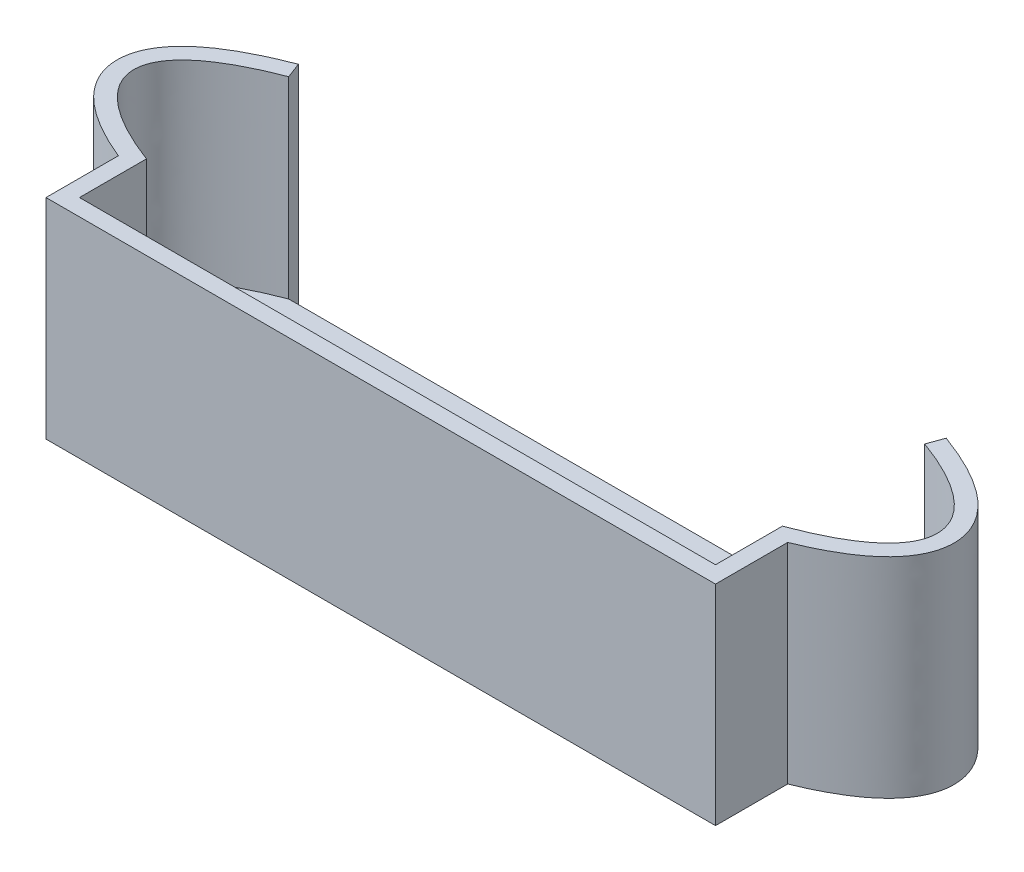
ISO-10303-21;
HEADER;
FILE_DESCRIPTION(('STEP AP214'),'2;1');
FILE_NAME('part.step','',(''),(''),'','','');
FILE_SCHEMA(('AUTOMOTIVE_DESIGN { 1 0 10303 214 1 1 1 1 }'));
ENDSEC;
DATA;
#1=APPLICATION_CONTEXT('core data for automotive mechanical design processes');
#2=APPLICATION_PROTOCOL_DEFINITION('international standard','automotive_design',2000,#1);
#3=PRODUCT_CONTEXT('',#1,'mechanical');
#4=PRODUCT('Part','Part','',(#3));
#5=PRODUCT_RELATED_PRODUCT_CATEGORY('part','',(#4));
#6=PRODUCT_DEFINITION_FORMATION('','',#4);
#7=PRODUCT_DEFINITION_CONTEXT('part definition',#1,'design');
#8=PRODUCT_DEFINITION('design','',#6,#7);
#9=PRODUCT_DEFINITION_SHAPE('','',#8);
#10=(LENGTH_UNIT() NAMED_UNIT(*) SI_UNIT(.MILLI.,.METRE.));
#11=(NAMED_UNIT(*) PLANE_ANGLE_UNIT() SI_UNIT($,.RADIAN.));
#12=(NAMED_UNIT(*) SI_UNIT($,.STERADIAN.) SOLID_ANGLE_UNIT());
#13=UNCERTAINTY_MEASURE_WITH_UNIT(LENGTH_MEASURE(1.E-05),#10,'distance_accuracy_value','');
#14=(GEOMETRIC_REPRESENTATION_CONTEXT(3) GLOBAL_UNCERTAINTY_ASSIGNED_CONTEXT((#13)) GLOBAL_UNIT_ASSIGNED_CONTEXT((#10,
#11,#12)) REPRESENTATION_CONTEXT('',''));
#15=CARTESIAN_POINT('',(0.,0.,0.));
#16=DIRECTION('',(0.,0.,1.));
#17=DIRECTION('',(1.,0.,0.));
#18=AXIS2_PLACEMENT_3D('',#15,#16,#17);
#19=CARTESIAN_POINT('',(-38.,25.,8.5));
#20=CARTESIAN_POINT('',(-44.0971734421418,25.,6.19197573313431));
#21=CARTESIAN_POINT('',(-51.2491163501438,25.,0.338068019417331));
#22=CARTESIAN_POINT('',(-45.4045938575706,25.,-5.68080966554712));
#23=CARTESIAN_POINT('',(-38.,25.,-8.5));
#24=B_SPLINE_CURVE_WITH_KNOTS('',3,(#19,#20,#21,#22,#23),.UNSPECIFIED.,.F.,.F.,(4,1,4),(0.,0.45,
1.),.UNSPECIFIED.);
#25=DIRECTION('',(0.,-1.,0.));
#26=VECTOR('',#25,1.);
#27=SURFACE_OF_LINEAR_EXTRUSION('',#24,#26);
#28=DIRECTION('',(0.,-1.,0.));
#29=VECTOR('',#28,1.);
#30=CARTESIAN_POINT('',(-38.,25.,8.5));
#31=LINE('',#30,#29);
#32=CARTESIAN_POINT('',(-38.,25.,8.5));
#33=VERTEX_POINT('',#32);
#34=CARTESIAN_POINT('',(-38.,2.,8.5));
#35=VERTEX_POINT('',#34);
#36=EDGE_CURVE('E224',#33,#35,#31,.T.);
#37=ORIENTED_EDGE('',*,*,#36,.T.);
#38=CARTESIAN_POINT('',(-38.,2.,-8.5));
#39=CARTESIAN_POINT('',(-45.4045938575706,2.,-5.68080966554712));
#40=CARTESIAN_POINT('',(-51.2491163501438,2.,0.338068019417331));
#41=CARTESIAN_POINT('',(-44.0971734421418,2.,6.19197573313431));
#42=CARTESIAN_POINT('',(-38.,2.,8.5));
#43=B_SPLINE_CURVE_WITH_KNOTS('',3,(#38,#39,#40,#41,#42),.UNSPECIFIED.,.F.,.F.,(4,1,4),(0.,0.55,
1.),.UNSPECIFIED.);
#44=CARTESIAN_POINT('',(-38.,2.,-8.5));
#45=VERTEX_POINT('',#44);
#46=EDGE_CURVE('E54',#45,#35,#43,.T.);
#47=ORIENTED_EDGE('',*,*,#46,.F.);
#48=DIRECTION('',(0.,-1.,0.));
#49=VECTOR('',#48,1.);
#50=CARTESIAN_POINT('',(-38.,25.,-8.5));
#51=LINE('',#50,#49);
#52=CARTESIAN_POINT('',(-38.,25.,-8.5));
#53=VERTEX_POINT('',#52);
#54=EDGE_CURVE('E11',#53,#45,#51,.T.);
#55=ORIENTED_EDGE('',*,*,#54,.F.);
#56=EDGE_CURVE('E255',#33,#53,#24,.T.);
#57=ORIENTED_EDGE('',*,*,#56,.F.);
#58=EDGE_LOOP('',(#37,#47,#55,#57));
#59=FACE_BOUND('',#58,.T.);
#60=ADVANCED_FACE('F37',(#59),#27,.F.);
#61=CARTESIAN_POINT('',(-38.7116363312719,25.,-10.3691104119377));
#62=DIRECTION('',(0.934555205968845,0.,-0.355818165635947));
#63=DIRECTION('',(-0.355818165635947,0.,-0.934555205968845));
#64=AXIS2_PLACEMENT_3D('',#61,#62,#63);
#65=PLANE('',#64);
#66=DIRECTION('',(0.355818165635947,0.,0.934555205968845));
#67=VECTOR('',#66,1.);
#68=CARTESIAN_POINT('',(-38.7116363312719,0.,-10.3691104119377));
#69=LINE('',#68,#67);
#70=CARTESIAN_POINT('',(-38.7116363312719,0.,-10.3691104119377));
#71=VERTEX_POINT('',#70);
#72=CARTESIAN_POINT('',(-38.,0.,-8.5));
#73=VERTEX_POINT('',#72);
#74=EDGE_CURVE('E196',#71,#73,#69,.T.);
#75=ORIENTED_EDGE('',*,*,#74,.F.);
#76=DIRECTION('',(0.,-1.,0.));
#77=VECTOR('',#76,1.);
#78=CARTESIAN_POINT('',(-38.7116363312719,25.,-10.3691104119377));
#79=LINE('',#78,#77);
#80=CARTESIAN_POINT('',(-38.7116363312719,25.,-10.3691104119377));
#81=VERTEX_POINT('',#80);
#82=EDGE_CURVE('E46',#81,#71,#79,.T.);
#83=ORIENTED_EDGE('',*,*,#82,.F.);
#84=DIRECTION('',(0.355818165635947,0.,0.934555205968845));
#85=VECTOR('',#84,1.);
#86=CARTESIAN_POINT('',(-38.7116363312719,25.,-10.3691104119377));
#87=LINE('',#86,#85);
#88=EDGE_CURVE('E337',#81,#53,#87,.T.);
#89=ORIENTED_EDGE('',*,*,#88,.T.);
#90=ORIENTED_EDGE('',*,*,#54,.T.);
#91=DIRECTION('',(0.,-1.,0.));
#92=VECTOR('',#91,1.);
#93=CARTESIAN_POINT('',(-38.,2.,-8.5));
#94=LINE('',#93,#92);
#95=EDGE_CURVE('E186',#45,#73,#94,.T.);
#96=ORIENTED_EDGE('',*,*,#95,.T.);
#97=EDGE_LOOP('',(#75,#83,#89,#90,#96));
#98=FACE_BOUND('',#97,.T.);
#99=ADVANCED_FACE('F346',(#98),#65,.T.);
#100=CARTESIAN_POINT('',(-40.,25.,9.85984179415552));
#101=CARTESIAN_POINT('',(-41.6063864526084,25.,9.19645826470229));
#102=CARTESIAN_POINT('',(-43.0174720162732,25.,8.50172508440663));
#103=CARTESIAN_POINT('',(-45.4697074365186,25.,7.03560230560447));
#104=CARTESIAN_POINT('',(-46.512220325183,25.,6.26485211397862));
#105=CARTESIAN_POINT('',(-47.8043142172775,25.,5.0167260805631));
#106=CARTESIAN_POINT('',(-48.1895286265625,25.,4.58490406327742));
#107=CARTESIAN_POINT('',(-48.8618289618267,25.,3.68164653878876));
#108=CARTESIAN_POINT('',(-49.1489459076632,25.,3.2098255576471));
#109=CARTESIAN_POINT('',(-49.6082667576355,25.,2.22445232530367));
#110=CARTESIAN_POINT('',(-49.7799238053162,25.,1.71080543782136));
#111=CARTESIAN_POINT('',(-49.9874166012136,25.,0.657795934772312));
#112=CARTESIAN_POINT('',(-50.0226849981645,25.,0.117692843150088));
#113=CARTESIAN_POINT('',(-49.9483087771157,25.,-0.954692848389449));
#114=CARTESIAN_POINT('',(-49.8389483432311,25.,-1.48594996611095));
#115=CARTESIAN_POINT('',(-49.4922541980677,25.,-2.51017001330792));
#116=CARTESIAN_POINT('',(-49.2556986890337,25.,-3.0031574293736));
#117=CARTESIAN_POINT('',(-48.6775995026154,25.,-3.94518996668276));
#118=CARTESIAN_POINT('',(-48.336215050652,25.,-4.3947265966794));
#119=CARTESIAN_POINT('',(-47.560818188255,25.,-5.25781189388135));
#120=CARTESIAN_POINT('',(-47.1266551704178,25.,-5.67159902471638));
#121=CARTESIAN_POINT('',(-45.6900809905153,25.,-6.87217662394887));
#122=CARTESIAN_POINT('',(-44.5538203088429,25.,-7.61960790130113));
#123=CARTESIAN_POINT('',(-41.9137015732495,25.,-9.04531685131512));
#124=CARTESIAN_POINT('',(-40.4090635509128,25.,-9.72283993402941));
#125=CARTESIAN_POINT('',(-38.7116363312719,25.,-10.3691104119377));
#126=B_SPLINE_CURVE_WITH_KNOTS('',3,(#100,#101,#102,#103,#104,#105,#106,#107,#108,#109,#110,
#111,#112,#113,#114,#115,#116,#117,#118,#119,#120,#121,#122,#123,#124,#125),.UNSPECIFIED.,.F.,
.F.,(4,2,2,2,2,2,2,2,2,2,2,2,4),(0.,0.125000000000001,0.250000000000001,0.312500000000001,
0.375000000000001,0.437500000000001,0.500000000000001,0.562500000000001,0.625000000000001,
0.687500000000001,0.750000000000001,0.875000000000001,1.),.UNSPECIFIED.);
#127=DIRECTION('',(0.,-1.,0.));
#128=VECTOR('',#127,1.);
#129=SURFACE_OF_LINEAR_EXTRUSION('',#126,#128);
#130=CARTESIAN_POINT('',(-40.,0.,9.85984179415552));
#131=CARTESIAN_POINT('',(-41.6063864526084,0.,9.19645826470229));
#132=CARTESIAN_POINT('',(-43.0174720162732,0.,8.50172508440663));
#133=CARTESIAN_POINT('',(-45.4697074365186,0.,7.03560230560447));
#134=CARTESIAN_POINT('',(-46.512220325183,0.,6.26485211397862));
#135=CARTESIAN_POINT('',(-47.8043142172775,0.,5.0167260805631));
#136=CARTESIAN_POINT('',(-48.1895286265625,0.,4.58490406327742));
#137=CARTESIAN_POINT('',(-48.8618289618267,0.,3.68164653878876));
#138=CARTESIAN_POINT('',(-49.1489459076632,0.,3.2098255576471));
#139=CARTESIAN_POINT('',(-49.6082667576355,0.,2.22445232530367));
#140=CARTESIAN_POINT('',(-49.7799238053162,0.,1.71080543782136));
#141=CARTESIAN_POINT('',(-49.9874166012136,0.,0.657795934772312));
#142=CARTESIAN_POINT('',(-50.0226849981645,0.,0.117692843150088));
#143=CARTESIAN_POINT('',(-49.9483087771157,0.,-0.954692848389449));
#144=CARTESIAN_POINT('',(-49.8389483432311,0.,-1.48594996611095));
#145=CARTESIAN_POINT('',(-49.4922541980677,0.,-2.51017001330792));
#146=CARTESIAN_POINT('',(-49.2556986890337,0.,-3.0031574293736));
#147=CARTESIAN_POINT('',(-48.6775995026154,0.,-3.94518996668276));
#148=CARTESIAN_POINT('',(-48.336215050652,0.,-4.3947265966794));
#149=CARTESIAN_POINT('',(-47.560818188255,0.,-5.25781189388135));
#150=CARTESIAN_POINT('',(-47.1266551704178,0.,-5.67159902471638));
#151=CARTESIAN_POINT('',(-45.6900809905153,0.,-6.87217662394887));
#152=CARTESIAN_POINT('',(-44.5538203088429,0.,-7.61960790130113));
#153=CARTESIAN_POINT('',(-41.9137015732495,0.,-9.04531685131512));
#154=CARTESIAN_POINT('',(-40.4090635509128,0.,-9.72283993402941));
#155=CARTESIAN_POINT('',(-38.7116363312719,0.,-10.3691104119377));
#156=B_SPLINE_CURVE_WITH_KNOTS('',3,(#130,#131,#132,#133,#134,#135,#136,#137,#138,#139,#140,
#141,#142,#143,#144,#145,#146,#147,#148,#149,#150,#151,#152,#153,#154,#155),.UNSPECIFIED.,.F.,
.F.,(4,2,2,2,2,2,2,2,2,2,2,2,4),(0.,0.125000000000001,0.250000000000001,0.312500000000001,
0.375000000000001,0.437500000000001,0.500000000000001,0.562500000000001,0.625000000000001,
0.687500000000001,0.750000000000001,0.875000000000001,1.),.UNSPECIFIED.);
#157=CARTESIAN_POINT('',(-40.,0.,9.85984179415552));
#158=VERTEX_POINT('',#157);
#159=EDGE_CURVE('E276',#158,#71,#156,.T.);
#160=ORIENTED_EDGE('',*,*,#159,.F.);
#161=DIRECTION('',(0.,-1.,0.));
#162=VECTOR('',#161,1.);
#163=CARTESIAN_POINT('',(-40.,25.,9.85984179415552));
#164=LINE('',#163,#162);
#165=CARTESIAN_POINT('',(-40.,25.,9.85984179415552));
#166=VERTEX_POINT('',#165);
#167=EDGE_CURVE('E221',#166,#158,#164,.T.);
#168=ORIENTED_EDGE('',*,*,#167,.F.);
#169=EDGE_CURVE('E331',#166,#81,#126,.T.);
#170=ORIENTED_EDGE('',*,*,#169,.T.);
#171=ORIENTED_EDGE('',*,*,#82,.T.);
#172=EDGE_LOOP('',(#160,#168,#170,#171));
#173=FACE_BOUND('',#172,.T.);
#174=ADVANCED_FACE('F342',(#173),#129,.T.);
#175=CARTESIAN_POINT('',(-40.,25.,8.5));
#176=DIRECTION('',(-1.,0.,0.));
#177=DIRECTION('',(0.,0.,1.));
#178=AXIS2_PLACEMENT_3D('',#175,#176,#177);
#179=PLANE('',#178);
#180=DIRECTION('',(0.,0.,-1.));
#181=VECTOR('',#180,1.);
#182=CARTESIAN_POINT('',(-40.,0.,8.5));
#183=LINE('',#182,#181);
#184=CARTESIAN_POINT('',(-40.,0.,18.5));
#185=VERTEX_POINT('',#184);
#186=EDGE_CURVE('E273',#185,#158,#183,.T.);
#187=ORIENTED_EDGE('',*,*,#186,.F.);
#188=DIRECTION('',(0.,-1.,0.));
#189=VECTOR('',#188,1.);
#190=CARTESIAN_POINT('',(-40.,25.,18.5));
#191=LINE('',#190,#189);
#192=CARTESIAN_POINT('',(-40.,25.,18.5));
#193=VERTEX_POINT('',#192);
#194=EDGE_CURVE('E219',#193,#185,#191,.T.);
#195=ORIENTED_EDGE('',*,*,#194,.F.);
#196=DIRECTION('',(0.,0.,-1.));
#197=VECTOR('',#196,1.);
#198=CARTESIAN_POINT('',(-40.,25.,8.5));
#199=LINE('',#198,#197);
#200=EDGE_CURVE('E328',#193,#166,#199,.T.);
#201=ORIENTED_EDGE('',*,*,#200,.T.);
#202=ORIENTED_EDGE('',*,*,#167,.T.);
#203=EDGE_LOOP('',(#187,#195,#201,#202));
#204=FACE_BOUND('',#203,.T.);
#205=ADVANCED_FACE('F345',(#204),#179,.T.);
#206=CARTESIAN_POINT('',(38.,25.,18.5));
#207=DIRECTION('',(0.,0.,1.));
#208=DIRECTION('',(1.,0.,0.));
#209=AXIS2_PLACEMENT_3D('',#206,#207,#208);
#210=PLANE('',#209);
#211=DIRECTION('',(-1.,0.,0.));
#212=VECTOR('',#211,1.);
#213=CARTESIAN_POINT('',(38.,0.,18.5));
#214=LINE('',#213,#212);
#215=CARTESIAN_POINT('',(40.,0.,18.5));
#216=VERTEX_POINT('',#215);
#217=EDGE_CURVE('E270',#216,#185,#214,.T.);
#218=ORIENTED_EDGE('',*,*,#217,.F.);
#219=DIRECTION('',(0.,-1.,0.));
#220=VECTOR('',#219,1.);
#221=CARTESIAN_POINT('',(40.,25.,18.5));
#222=LINE('',#221,#220);
#223=CARTESIAN_POINT('',(40.,25.,18.5));
#224=VERTEX_POINT('',#223);
#225=EDGE_CURVE('E217',#224,#216,#222,.T.);
#226=ORIENTED_EDGE('',*,*,#225,.F.);
#227=DIRECTION('',(-1.,0.,0.));
#228=VECTOR('',#227,1.);
#229=CARTESIAN_POINT('',(38.,25.,18.5));
#230=LINE('',#229,#228);
#231=EDGE_CURVE('E325',#224,#193,#230,.T.);
#232=ORIENTED_EDGE('',*,*,#231,.T.);
#233=ORIENTED_EDGE('',*,*,#194,.T.);
#234=EDGE_LOOP('',(#218,#226,#232,#233));
#235=FACE_BOUND('',#234,.T.);
#236=ADVANCED_FACE('F367',(#235),#210,.T.);
#237=CARTESIAN_POINT('',(40.,25.,16.5));
#238=DIRECTION('',(1.,0.,0.));
#239=DIRECTION('',(0.,0.,-1.));
#240=AXIS2_PLACEMENT_3D('',#237,#238,#239);
#241=PLANE('',#240);
#242=DIRECTION('',(0.,0.,-1.));
#243=VECTOR('',#242,1.);
#244=CARTESIAN_POINT('',(40.,0.,16.5));
#245=LINE('',#244,#243);
#246=CARTESIAN_POINT('',(40.,0.,9.87368656754377));
#247=VERTEX_POINT('',#246);
#248=EDGE_CURVE('E264',#247,#216,#245,.F.);
#249=ORIENTED_EDGE('',*,*,#248,.F.);
#250=DIRECTION('',(0.,-1.,0.));
#251=VECTOR('',#250,1.);
#252=CARTESIAN_POINT('',(40.,25.,9.87368656754377));
#253=LINE('',#252,#251);
#254=CARTESIAN_POINT('',(40.,25.,9.87368656754377));
#255=VERTEX_POINT('',#254);
#256=EDGE_CURVE('E203',#255,#247,#253,.T.);
#257=ORIENTED_EDGE('',*,*,#256,.F.);
#258=DIRECTION('',(0.,0.,-1.));
#259=VECTOR('',#258,1.);
#260=CARTESIAN_POINT('',(40.,25.,16.5));
#261=LINE('',#260,#259);
#262=EDGE_CURVE('E319',#255,#224,#261,.F.);
#263=ORIENTED_EDGE('',*,*,#262,.T.);
#264=ORIENTED_EDGE('',*,*,#225,.T.);
#265=EDGE_LOOP('',(#249,#257,#263,#264));
#266=FACE_BOUND('',#265,.T.);
#267=ADVANCED_FACE('F310',(#266),#241,.T.);
#268=CARTESIAN_POINT('',(38.6840402866513,25.,-10.3793852415718));
#269=CARTESIAN_POINT('',(40.4041465230962,25.,-9.75331777173025));
#270=CARTESIAN_POINT('',(41.9229970966462,25.,-9.08800470112597));
#271=CARTESIAN_POINT('',(44.5807786086229,25.,-7.67329587995447));
#272=CARTESIAN_POINT('',(45.7205980606713,25.,-6.92450869545767));
#273=CARTESIAN_POINT('',(47.1569084210353,25.,-5.7145854775236));
#274=CARTESIAN_POINT('',(47.5900013984811,25.,-5.29648160097566));
#275=CARTESIAN_POINT('',(48.3613112665575,25.,-4.42375033228293));
#276=CARTESIAN_POINT('',(48.6996296746018,25.,-3.96888379386021));
#277=CARTESIAN_POINT('',(49.2702102761331,25.,-3.01773228404028));
#278=CARTESIAN_POINT('',(49.5022653836234,25.,-2.52105780820636));
#279=CARTESIAN_POINT('',(49.8414781111882,25.,-1.49356308768047));
#280=CARTESIAN_POINT('',(49.9483170520087,25.,-0.963257165414898));
#281=CARTESIAN_POINT('',(50.022307254117,25.,0.110491836494699));
#282=CARTESIAN_POINT('',(49.988715689813,25.,0.65260655556458));
#283=CARTESIAN_POINT('',(49.7839180039266,25.,1.71370272063874));
#284=CARTESIAN_POINT('',(49.6133325526311,25.,2.23212300577642));
#285=CARTESIAN_POINT('',(49.1553780326123,25.,3.22679565727581));
#286=CARTESIAN_POINT('',(48.8684940733341,25.,3.70336233424624));
#287=CARTESIAN_POINT('',(48.1957238702478,25.,4.61535639178563));
#288=CARTESIAN_POINT('',(47.809819506945,25.,5.05115075983745));
#289=CARTESIAN_POINT('',(46.5149676868667,25.,6.30860523877756));
#290=CARTESIAN_POINT('',(45.4697633562874,25.,7.08204391798738));
#291=CARTESIAN_POINT('',(43.0147461426226,25.,8.54162187618837));
#292=CARTESIAN_POINT('',(41.6035652881565,25.,9.22719501734774));
#293=CARTESIAN_POINT('',(40.,25.,9.87368656754377));
#294=B_SPLINE_CURVE_WITH_KNOTS('',3,(#268,#269,#270,#271,#272,#273,#274,#275,#276,#277,#278,
#279,#280,#281,#282,#283,#284,#285,#286,#287,#288,#289,#290,#291,#292,#293),.UNSPECIFIED.,.F.,
.F.,(4,2,2,2,2,2,2,2,2,2,2,2,4),(0.,0.125,0.25,0.3125,0.375,0.4375,0.5,0.5625,0.625000000000001,
0.687500000000001,0.750000000000001,0.875,1.),.UNSPECIFIED.);
#295=DIRECTION('',(0.,-1.,0.));
#296=VECTOR('',#295,1.);
#297=SURFACE_OF_LINEAR_EXTRUSION('',#294,#296);
#298=CARTESIAN_POINT('',(38.6840402866513,0.,-10.3793852415718));
#299=CARTESIAN_POINT('',(40.4041465230962,0.,-9.75331777173025));
#300=CARTESIAN_POINT('',(41.9229970966462,0.,-9.08800470112597));
#301=CARTESIAN_POINT('',(44.5807786086229,0.,-7.67329587995447));
#302=CARTESIAN_POINT('',(45.7205980606713,0.,-6.92450869545767));
#303=CARTESIAN_POINT('',(47.1569084210353,0.,-5.7145854775236));
#304=CARTESIAN_POINT('',(47.5900013984811,0.,-5.29648160097566));
#305=CARTESIAN_POINT('',(48.3613112665575,0.,-4.42375033228293));
#306=CARTESIAN_POINT('',(48.6996296746018,0.,-3.96888379386021));
#307=CARTESIAN_POINT('',(49.2702102761331,0.,-3.01773228404028));
#308=CARTESIAN_POINT('',(49.5022653836234,0.,-2.52105780820636));
#309=CARTESIAN_POINT('',(49.8414781111882,0.,-1.49356308768047));
#310=CARTESIAN_POINT('',(49.9483170520087,0.,-0.963257165414898));
#311=CARTESIAN_POINT('',(50.022307254117,0.,0.110491836494699));
#312=CARTESIAN_POINT('',(49.988715689813,0.,0.65260655556458));
#313=CARTESIAN_POINT('',(49.7839180039266,0.,1.71370272063874));
#314=CARTESIAN_POINT('',(49.6133325526311,0.,2.23212300577642));
#315=CARTESIAN_POINT('',(49.1553780326123,0.,3.22679565727581));
#316=CARTESIAN_POINT('',(48.8684940733341,0.,3.70336233424624));
#317=CARTESIAN_POINT('',(48.1957238702478,0.,4.61535639178563));
#318=CARTESIAN_POINT('',(47.809819506945,0.,5.05115075983745));
#319=CARTESIAN_POINT('',(46.5149676868667,0.,6.30860523877756));
#320=CARTESIAN_POINT('',(45.4697633562874,0.,7.08204391798738));
#321=CARTESIAN_POINT('',(43.0147461426226,0.,8.54162187618837));
#322=CARTESIAN_POINT('',(41.6035652881565,0.,9.22719501734774));
#323=CARTESIAN_POINT('',(40.,0.,9.87368656754377));
#324=B_SPLINE_CURVE_WITH_KNOTS('',3,(#298,#299,#300,#301,#302,#303,#304,#305,#306,#307,#308,
#309,#310,#311,#312,#313,#314,#315,#316,#317,#318,#319,#320,#321,#322,#323),.UNSPECIFIED.,.F.,
.F.,(4,2,2,2,2,2,2,2,2,2,2,2,4),(0.,0.125,0.25,0.3125,0.375,0.4375,0.5,0.5625,0.625000000000001,
0.687500000000001,0.750000000000001,0.875,1.),.UNSPECIFIED.);
#325=CARTESIAN_POINT('',(38.6840402866513,0.,-10.3793852415718));
#326=VERTEX_POINT('',#325);
#327=EDGE_CURVE('E259',#326,#247,#324,.T.);
#328=ORIENTED_EDGE('',*,*,#327,.F.);
#329=DIRECTION('',(0.,-1.,0.));
#330=VECTOR('',#329,1.);
#331=CARTESIAN_POINT('',(38.6840402866513,25.,-10.3793852415718));
#332=LINE('',#331,#330);
#333=CARTESIAN_POINT('',(38.6840402866513,25.,-10.3793852415718));
#334=VERTEX_POINT('',#333);
#335=EDGE_CURVE('E200',#334,#326,#332,.T.);
#336=ORIENTED_EDGE('',*,*,#335,.F.);
#337=EDGE_CURVE('E313',#334,#255,#294,.T.);
#338=ORIENTED_EDGE('',*,*,#337,.T.);
#339=ORIENTED_EDGE('',*,*,#256,.T.);
#340=EDGE_LOOP('',(#328,#336,#338,#339));
#341=FACE_BOUND('',#340,.T.);
#342=ADVANCED_FACE('F307',(#341),#297,.T.);
#343=CARTESIAN_POINT('',(38.,25.,-8.50000000000001));
#344=DIRECTION('',(-0.939692620785908,0.,-0.342020143325669));
#345=DIRECTION('',(-0.342020143325669,0.,0.939692620785908));
#346=AXIS2_PLACEMENT_3D('',#343,#344,#345);
#347=PLANE('',#346);
#348=DIRECTION('',(0.342020143325669,0.,-0.939692620785908));
#349=VECTOR('',#348,1.);
#350=CARTESIAN_POINT('',(38.,0.,-8.50000000000001));
#351=LINE('',#350,#349);
#352=CARTESIAN_POINT('',(38.,0.,-8.5));
#353=VERTEX_POINT('',#352);
#354=EDGE_CURVE('E195',#353,#326,#351,.T.);
#355=ORIENTED_EDGE('',*,*,#354,.F.);
#356=DIRECTION('',(0.,-1.,0.));
#357=VECTOR('',#356,1.);
#358=CARTESIAN_POINT('',(38.,2.,-8.5));
#359=LINE('',#358,#357);
#360=CARTESIAN_POINT('',(38.,2.,-8.5));
#361=VERTEX_POINT('',#360);
#362=EDGE_CURVE('E184',#361,#353,#359,.T.);
#363=ORIENTED_EDGE('',*,*,#362,.F.);
#364=DIRECTION('',(0.,-1.,0.));
#365=VECTOR('',#364,1.);
#366=CARTESIAN_POINT('',(38.,25.,-8.50000000000001));
#367=LINE('',#366,#365);
#368=CARTESIAN_POINT('',(38.,25.,-8.50000000000001));
#369=VERTEX_POINT('',#368);
#370=EDGE_CURVE('E192',#369,#361,#367,.T.);
#371=ORIENTED_EDGE('',*,*,#370,.F.);
#372=DIRECTION('',(0.342020143325669,0.,-0.939692620785908));
#373=VECTOR('',#372,1.);
#374=CARTESIAN_POINT('',(38.,25.,-8.50000000000001));
#375=LINE('',#374,#373);
#376=EDGE_CURVE('E294',#369,#334,#375,.T.);
#377=ORIENTED_EDGE('',*,*,#376,.T.);
#378=ORIENTED_EDGE('',*,*,#335,.T.);
#379=EDGE_LOOP('',(#355,#363,#371,#377,#378));
#380=FACE_BOUND('',#379,.T.);
#381=ADVANCED_FACE('F190',(#380),#347,.T.);
#382=CARTESIAN_POINT('',(38.,25.,-8.50000000000001));
#383=CARTESIAN_POINT('',(44.1262265687642,25.,-6.27023588059907));
#384=CARTESIAN_POINT('',(51.2239369737377,25.,-0.356097076359375));
#385=CARTESIAN_POINT('',(45.4258994837604,25.,5.77760659667593));
#386=CARTESIAN_POINT('',(38.,25.,8.49999999999999));
#387=B_SPLINE_CURVE_WITH_KNOTS('',3,(#382,#383,#384,#385,#386),.UNSPECIFIED.,.F.,.F.,(4,1,4),
(0.,0.45,1.),.UNSPECIFIED.);
#388=DIRECTION('',(0.,-1.,0.));
#389=VECTOR('',#388,1.);
#390=SURFACE_OF_LINEAR_EXTRUSION('',#387,#389);
#391=ORIENTED_EDGE('',*,*,#370,.T.);
#392=CARTESIAN_POINT('',(38.,2.,-8.50000000000001));
#393=CARTESIAN_POINT('',(44.1262265687642,2.,-6.27023588059907));
#394=CARTESIAN_POINT('',(51.2239369737377,2.,-0.356097076359375));
#395=CARTESIAN_POINT('',(45.4258994837604,2.,5.77760659667593));
#396=CARTESIAN_POINT('',(38.,2.,8.49999999999999));
#397=B_SPLINE_CURVE_WITH_KNOTS('',3,(#392,#393,#394,#395,#396),.UNSPECIFIED.,.F.,.F.,(4,1,4),
(0.,0.45,1.),.UNSPECIFIED.);
#398=CARTESIAN_POINT('',(38.,2.,8.5));
#399=VERTEX_POINT('',#398);
#400=EDGE_CURVE('E167',#361,#399,#397,.T.);
#401=ORIENTED_EDGE('',*,*,#400,.T.);
#402=DIRECTION('',(0.,-1.,0.));
#403=VECTOR('',#402,1.);
#404=CARTESIAN_POINT('',(38.,25.,8.5));
#405=LINE('',#404,#403);
#406=CARTESIAN_POINT('',(38.,25.,8.5));
#407=VERTEX_POINT('',#406);
#408=EDGE_CURVE('E201',#407,#399,#405,.T.);
#409=ORIENTED_EDGE('',*,*,#408,.F.);
#410=EDGE_CURVE('E198',#369,#407,#387,.T.);
#411=ORIENTED_EDGE('',*,*,#410,.F.);
#412=EDGE_LOOP('',(#391,#401,#409,#411));
#413=FACE_BOUND('',#412,.T.);
#414=ADVANCED_FACE('F197',(#413),#390,.F.);
#415=CARTESIAN_POINT('',(38.,25.,16.5));
#416=DIRECTION('',(1.,0.,0.));
#417=DIRECTION('',(0.,0.,-1.));
#418=AXIS2_PLACEMENT_3D('',#415,#416,#417);
#419=PLANE('',#418);
#420=DIRECTION('',(0.,0.,1.));
#421=VECTOR('',#420,1.);
#422=CARTESIAN_POINT('',(38.,0.,16.5));
#423=LINE('',#422,#421);
#424=CARTESIAN_POINT('',(38.,0.,8.5));
#425=VERTEX_POINT('',#424);
#426=CARTESIAN_POINT('',(38.,0.,16.5));
#427=VERTEX_POINT('',#426);
#428=EDGE_CURVE('E251',#425,#427,#423,.T.);
#429=ORIENTED_EDGE('',*,*,#428,.T.);
#430=DIRECTION('',(0.,-1.,0.));
#431=VECTOR('',#430,1.);
#432=CARTESIAN_POINT('',(38.,25.,16.5));
#433=LINE('',#432,#431);
#434=CARTESIAN_POINT('',(38.,25.,16.5));
#435=VERTEX_POINT('',#434);
#436=EDGE_CURVE('E205',#435,#427,#433,.T.);
#437=ORIENTED_EDGE('',*,*,#436,.F.);
#438=DIRECTION('',(0.,0.,1.));
#439=VECTOR('',#438,1.);
#440=CARTESIAN_POINT('',(38.,25.,16.5));
#441=LINE('',#440,#439);
#442=EDGE_CURVE('E288',#407,#435,#441,.T.);
#443=ORIENTED_EDGE('',*,*,#442,.F.);
#444=ORIENTED_EDGE('',*,*,#408,.T.);
#445=DIRECTION('',(0.,-1.,0.));
#446=VECTOR('',#445,1.);
#447=CARTESIAN_POINT('',(38.,2.,8.5));
#448=LINE('',#447,#446);
#449=EDGE_CURVE('E560',#399,#425,#448,.T.);
#450=ORIENTED_EDGE('',*,*,#449,.T.);
#451=EDGE_LOOP('',(#429,#437,#443,#444,#450));
#452=FACE_BOUND('',#451,.T.);
#453=ADVANCED_FACE('F303',(#452),#419,.F.);
#454=CARTESIAN_POINT('',(38.,25.,16.5));
#455=DIRECTION('',(0.,0.,1.));
#456=DIRECTION('',(1.,0.,0.));
#457=AXIS2_PLACEMENT_3D('',#454,#455,#456);
#458=PLANE('',#457);
#459=DIRECTION('',(-1.,0.,0.));
#460=VECTOR('',#459,1.);
#461=CARTESIAN_POINT('',(0.,2.,16.5));
#462=LINE('',#461,#460);
#463=CARTESIAN_POINT('',(2.4423397518385,2.,16.5));
#464=VERTEX_POINT('',#463);
#465=CARTESIAN_POINT('',(-2.5576602481615,2.,16.5));
#466=VERTEX_POINT('',#465);
#467=EDGE_CURVE('E61',#464,#466,#462,.T.);
#468=ORIENTED_EDGE('',*,*,#467,.T.);
#469=DIRECTION('',(0.,-1.,0.));
#470=VECTOR('',#469,1.);
#471=CARTESIAN_POINT('',(-2.5576602481615,2.,16.5));
#472=LINE('',#471,#470);
#473=CARTESIAN_POINT('',(-2.5576602481615,0.,16.5));
#474=VERTEX_POINT('',#473);
#475=EDGE_CURVE('E562',#466,#474,#472,.T.);
#476=ORIENTED_EDGE('',*,*,#475,.T.);
#477=DIRECTION('',(-1.,0.,0.));
#478=VECTOR('',#477,1.);
#479=CARTESIAN_POINT('',(38.,0.,16.5));
#480=LINE('',#479,#478);
#481=CARTESIAN_POINT('',(-38.,0.,16.5));
#482=VERTEX_POINT('',#481);
#483=EDGE_CURVE('E254',#474,#482,#480,.T.);
#484=ORIENTED_EDGE('',*,*,#483,.T.);
#485=DIRECTION('',(0.,-1.,0.));
#486=VECTOR('',#485,1.);
#487=CARTESIAN_POINT('',(-38.,25.,16.5));
#488=LINE('',#487,#486);
#489=CARTESIAN_POINT('',(-38.,25.,16.5));
#490=VERTEX_POINT('',#489);
#491=EDGE_CURVE('E226',#490,#482,#488,.T.);
#492=ORIENTED_EDGE('',*,*,#491,.F.);
#493=DIRECTION('',(-1.,0.,0.));
#494=VECTOR('',#493,1.);
#495=CARTESIAN_POINT('',(38.,25.,16.5));
#496=LINE('',#495,#494);
#497=EDGE_CURVE('E242',#435,#490,#496,.T.);
#498=ORIENTED_EDGE('',*,*,#497,.F.);
#499=ORIENTED_EDGE('',*,*,#436,.T.);
#500=CARTESIAN_POINT('',(2.4423397518385,0.,16.5));
#501=VERTEX_POINT('',#500);
#502=EDGE_CURVE('E239',#427,#501,#480,.T.);
#503=ORIENTED_EDGE('',*,*,#502,.T.);
#504=DIRECTION('',(0.,-1.,0.));
#505=VECTOR('',#504,1.);
#506=CARTESIAN_POINT('',(2.4423397518385,2.,16.5));
#507=LINE('',#506,#505);
#508=EDGE_CURVE('E559',#464,#501,#507,.T.);
#509=ORIENTED_EDGE('',*,*,#508,.F.);
#510=EDGE_LOOP('',(#468,#476,#484,#492,#498,#499,#503,#509));
#511=FACE_BOUND('',#510,.T.);
#512=ADVANCED_FACE('F238',(#511),#458,.F.);
#513=CARTESIAN_POINT('',(-38.,25.,8.5));
#514=DIRECTION('',(-1.,0.,0.));
#515=DIRECTION('',(0.,0.,1.));
#516=AXIS2_PLACEMENT_3D('',#513,#514,#515);
#517=PLANE('',#516);
#518=DIRECTION('',(0.,0.,-1.));
#519=VECTOR('',#518,1.);
#520=CARTESIAN_POINT('',(-38.,0.,8.5));
#521=LINE('',#520,#519);
#522=CARTESIAN_POINT('',(-38.,0.,8.5));
#523=VERTEX_POINT('',#522);
#524=EDGE_CURVE('E231',#482,#523,#521,.T.);
#525=ORIENTED_EDGE('',*,*,#524,.T.);
#526=DIRECTION('',(0.,-1.,0.));
#527=VECTOR('',#526,1.);
#528=CARTESIAN_POINT('',(-38.,2.,8.5));
#529=LINE('',#528,#527);
#530=EDGE_CURVE('E547',#35,#523,#529,.T.);
#531=ORIENTED_EDGE('',*,*,#530,.F.);
#532=ORIENTED_EDGE('',*,*,#36,.F.);
#533=DIRECTION('',(0.,0.,-1.));
#534=VECTOR('',#533,1.);
#535=CARTESIAN_POINT('',(-38.,25.,8.5));
#536=LINE('',#535,#534);
#537=EDGE_CURVE('E227',#490,#33,#536,.T.);
#538=ORIENTED_EDGE('',*,*,#537,.F.);
#539=ORIENTED_EDGE('',*,*,#491,.T.);
#540=EDGE_LOOP('',(#525,#531,#532,#538,#539));
#541=FACE_BOUND('',#540,.T.);
#542=ADVANCED_FACE('F378',(#541),#517,.F.);
#543=CARTESIAN_POINT('',(-48.,25.,0.));
#544=DIRECTION('',(0.,1.,0.));
#545=DIRECTION('',(1.,0.,0.));
#546=AXIS2_PLACEMENT_3D('',#543,#544,#545);
#547=PLANE('',#546);
#548=ORIENTED_EDGE('',*,*,#56,.T.);
#549=ORIENTED_EDGE('',*,*,#88,.F.);
#550=ORIENTED_EDGE('',*,*,#169,.F.);
#551=ORIENTED_EDGE('',*,*,#200,.F.);
#552=ORIENTED_EDGE('',*,*,#231,.F.);
#553=ORIENTED_EDGE('',*,*,#262,.F.);
#554=ORIENTED_EDGE('',*,*,#337,.F.);
#555=ORIENTED_EDGE('',*,*,#376,.F.);
#556=ORIENTED_EDGE('',*,*,#410,.T.);
#557=ORIENTED_EDGE('',*,*,#442,.T.);
#558=ORIENTED_EDGE('',*,*,#497,.T.);
#559=ORIENTED_EDGE('',*,*,#537,.T.);
#560=EDGE_LOOP('',(#548,#549,#550,#551,#552,#553,#554,#555,#556,#557,#558,#559));
#561=FACE_BOUND('',#560,.T.);
#562=ADVANCED_FACE('F362',(#561),#547,.T.);
#563=CARTESIAN_POINT('',(-48.,0.,0.));
#564=DIRECTION('',(0.,1.,0.));
#565=DIRECTION('',(1.,0.,0.));
#566=AXIS2_PLACEMENT_3D('',#563,#564,#565);
#567=PLANE('',#566);
#568=ORIENTED_EDGE('',*,*,#74,.T.);
#569=DIRECTION('',(1.,0.,0.));
#570=VECTOR('',#569,1.);
#571=CARTESIAN_POINT('',(0.,0.,-8.5));
#572=LINE('',#571,#570);
#573=EDGE_CURVE('E550',#73,#353,#572,.T.);
#574=ORIENTED_EDGE('',*,*,#573,.T.);
#575=ORIENTED_EDGE('',*,*,#354,.T.);
#576=ORIENTED_EDGE('',*,*,#327,.T.);
#577=ORIENTED_EDGE('',*,*,#248,.T.);
#578=ORIENTED_EDGE('',*,*,#217,.T.);
#579=ORIENTED_EDGE('',*,*,#186,.T.);
#580=ORIENTED_EDGE('',*,*,#159,.T.);
#581=EDGE_LOOP('',(#568,#574,#575,#576,#577,#578,#579,#580));
#582=FACE_BOUND('',#581,.T.);
#583=ORIENTED_EDGE('',*,*,#428,.F.);
#584=DIRECTION('',(-1.,0.,0.));
#585=VECTOR('',#584,1.);
#586=CARTESIAN_POINT('',(0.,0.,8.5));
#587=LINE('',#586,#585);
#588=CARTESIAN_POINT('',(2.4423397518385,0.,8.5));
#589=VERTEX_POINT('',#588);
#590=EDGE_CURVE('E177',#425,#589,#587,.T.);
#591=ORIENTED_EDGE('',*,*,#590,.T.);
#592=DIRECTION('',(0.,0.,-1.));
#593=VECTOR('',#592,1.);
#594=CARTESIAN_POINT('',(2.4423397518385,0.,0.));
#595=LINE('',#594,#593);
#596=EDGE_CURVE('E253',#501,#589,#595,.T.);
#597=ORIENTED_EDGE('',*,*,#596,.F.);
#598=ORIENTED_EDGE('',*,*,#502,.F.);
#599=EDGE_LOOP('',(#583,#591,#597,#598));
#600=FACE_BOUND('',#599,.T.);
#601=CARTESIAN_POINT('',(-2.5576602481615,0.,8.5));
#602=VERTEX_POINT('',#601);
#603=EDGE_CURVE('E542',#602,#523,#587,.T.);
#604=ORIENTED_EDGE('',*,*,#603,.T.);
#605=ORIENTED_EDGE('',*,*,#524,.F.);
#606=ORIENTED_EDGE('',*,*,#483,.F.);
#607=DIRECTION('',(0.,0.,-1.));
#608=VECTOR('',#607,1.);
#609=CARTESIAN_POINT('',(-2.5576602481615,0.,0.));
#610=LINE('',#609,#608);
#611=EDGE_CURVE('E549',#474,#602,#610,.T.);
#612=ORIENTED_EDGE('',*,*,#611,.T.);
#613=EDGE_LOOP('',(#604,#605,#606,#612));
#614=FACE_BOUND('',#613,.T.);
#615=ADVANCED_FACE('F248',(#582,#600,#614),#567,.F.);
#616=CARTESIAN_POINT('',(0.,2.,-8.5));
#617=DIRECTION('',(0.,0.,-1.));
#618=DIRECTION('',(-1.,0.,0.));
#619=AXIS2_PLACEMENT_3D('',#616,#617,#618);
#620=PLANE('',#619);
#621=ORIENTED_EDGE('',*,*,#573,.F.);
#622=ORIENTED_EDGE('',*,*,#95,.F.);
#623=DIRECTION('',(1.,0.,0.));
#624=VECTOR('',#623,1.);
#625=CARTESIAN_POINT('',(0.,2.,-8.5));
#626=LINE('',#625,#624);
#627=EDGE_CURVE('E170',#45,#361,#626,.T.);
#628=ORIENTED_EDGE('',*,*,#627,.T.);
#629=ORIENTED_EDGE('',*,*,#362,.T.);
#630=EDGE_LOOP('',(#621,#622,#628,#629));
#631=FACE_BOUND('',#630,.T.);
#632=ADVANCED_FACE('F183',(#631),#620,.T.);
#633=CARTESIAN_POINT('',(0.,2.,8.5));
#634=DIRECTION('',(0.,0.,1.));
#635=DIRECTION('',(1.,0.,0.));
#636=AXIS2_PLACEMENT_3D('',#633,#634,#635);
#637=PLANE('',#636);
#638=ORIENTED_EDGE('',*,*,#603,.F.);
#639=DIRECTION('',(0.,-1.,0.));
#640=VECTOR('',#639,1.);
#641=CARTESIAN_POINT('',(-2.5576602481615,2.,8.5));
#642=LINE('',#641,#640);
#643=CARTESIAN_POINT('',(-2.5576602481615,2.,8.5));
#644=VERTEX_POINT('',#643);
#645=EDGE_CURVE('E545',#644,#602,#642,.T.);
#646=ORIENTED_EDGE('',*,*,#645,.F.);
#647=DIRECTION('',(-1.,0.,0.));
#648=VECTOR('',#647,1.);
#649=CARTESIAN_POINT('',(0.,2.,8.5));
#650=LINE('',#649,#648);
#651=EDGE_CURVE('E574',#644,#35,#650,.T.);
#652=ORIENTED_EDGE('',*,*,#651,.T.);
#653=ORIENTED_EDGE('',*,*,#530,.T.);
#654=EDGE_LOOP('',(#638,#646,#652,#653));
#655=FACE_BOUND('',#654,.T.);
#656=ADVANCED_FACE('F391',(#655),#637,.T.);
#657=CARTESIAN_POINT('',(-2.5576602481615,2.,0.));
#658=DIRECTION('',(-1.,0.,0.));
#659=DIRECTION('',(0.,0.,1.));
#660=AXIS2_PLACEMENT_3D('',#657,#658,#659);
#661=PLANE('',#660);
#662=ORIENTED_EDGE('',*,*,#611,.F.);
#663=ORIENTED_EDGE('',*,*,#475,.F.);
#664=DIRECTION('',(0.,0.,-1.));
#665=VECTOR('',#664,1.);
#666=CARTESIAN_POINT('',(-2.5576602481615,2.,0.));
#667=LINE('',#666,#665);
#668=EDGE_CURVE('E577',#466,#644,#667,.T.);
#669=ORIENTED_EDGE('',*,*,#668,.T.);
#670=ORIENTED_EDGE('',*,*,#645,.T.);
#671=EDGE_LOOP('',(#662,#663,#669,#670));
#672=FACE_BOUND('',#671,.T.);
#673=ADVANCED_FACE('F392',(#672),#661,.T.);
#674=CARTESIAN_POINT('',(2.4423397518385,2.,0.));
#675=DIRECTION('',(-1.,0.,0.));
#676=DIRECTION('',(0.,0.,1.));
#677=AXIS2_PLACEMENT_3D('',#674,#675,#676);
#678=PLANE('',#677);
#679=ORIENTED_EDGE('',*,*,#596,.T.);
#680=DIRECTION('',(0.,-1.,0.));
#681=VECTOR('',#680,1.);
#682=CARTESIAN_POINT('',(2.4423397518385,2.,8.5));
#683=LINE('',#682,#681);
#684=CARTESIAN_POINT('',(2.4423397518385,2.,8.5));
#685=VERTEX_POINT('',#684);
#686=EDGE_CURVE('E557',#685,#589,#683,.T.);
#687=ORIENTED_EDGE('',*,*,#686,.F.);
#688=DIRECTION('',(0.,0.,-1.));
#689=VECTOR('',#688,1.);
#690=CARTESIAN_POINT('',(2.4423397518385,2.,0.));
#691=LINE('',#690,#689);
#692=EDGE_CURVE('E592',#464,#685,#691,.T.);
#693=ORIENTED_EDGE('',*,*,#692,.F.);
#694=ORIENTED_EDGE('',*,*,#508,.T.);
#695=EDGE_LOOP('',(#679,#687,#693,#694));
#696=FACE_BOUND('',#695,.T.);
#697=ADVANCED_FACE('F395',(#696),#678,.F.);
#698=ORIENTED_EDGE('',*,*,#590,.F.);
#699=ORIENTED_EDGE('',*,*,#449,.F.);
#700=EDGE_CURVE('E172',#399,#685,#650,.T.);
#701=ORIENTED_EDGE('',*,*,#700,.T.);
#702=ORIENTED_EDGE('',*,*,#686,.T.);
#703=EDGE_LOOP('',(#698,#699,#701,#702));
#704=FACE_BOUND('',#703,.T.);
#705=ADVANCED_FACE('F399',(#704),#637,.T.);
#706=CARTESIAN_POINT('',(0.,2.,0.));
#707=DIRECTION('',(0.,1.,0.));
#708=DIRECTION('',(0.,0.,1.));
#709=AXIS2_PLACEMENT_3D('',#706,#707,#708);
#710=PLANE('',#709);
#711=ORIENTED_EDGE('',*,*,#400,.F.);
#712=ORIENTED_EDGE('',*,*,#627,.F.);
#713=ORIENTED_EDGE('',*,*,#46,.T.);
#714=ORIENTED_EDGE('',*,*,#651,.F.);
#715=ORIENTED_EDGE('',*,*,#668,.F.);
#716=ORIENTED_EDGE('',*,*,#467,.F.);
#717=ORIENTED_EDGE('',*,*,#692,.T.);
#718=ORIENTED_EDGE('',*,*,#700,.F.);
#719=EDGE_LOOP('',(#711,#712,#713,#714,#715,#716,#717,#718));
#720=FACE_BOUND('',#719,.T.);
#721=ADVANCED_FACE('F169',(#720),#710,.T.);
#722=CLOSED_SHELL('',(#60,#99,#174,#205,#236,#267,#342,#381,#414,#453,#512,#542,#562,#615,#632,
#656,#673,#697,#705,#721));
#723=MANIFOLD_SOLID_BREP('B2',#722);
#724=ADVANCED_BREP_SHAPE_REPRESENTATION('',(#18,#723),#14);
#725=SHAPE_DEFINITION_REPRESENTATION(#9,#724);
ENDSEC;
END-ISO-10303-21;
